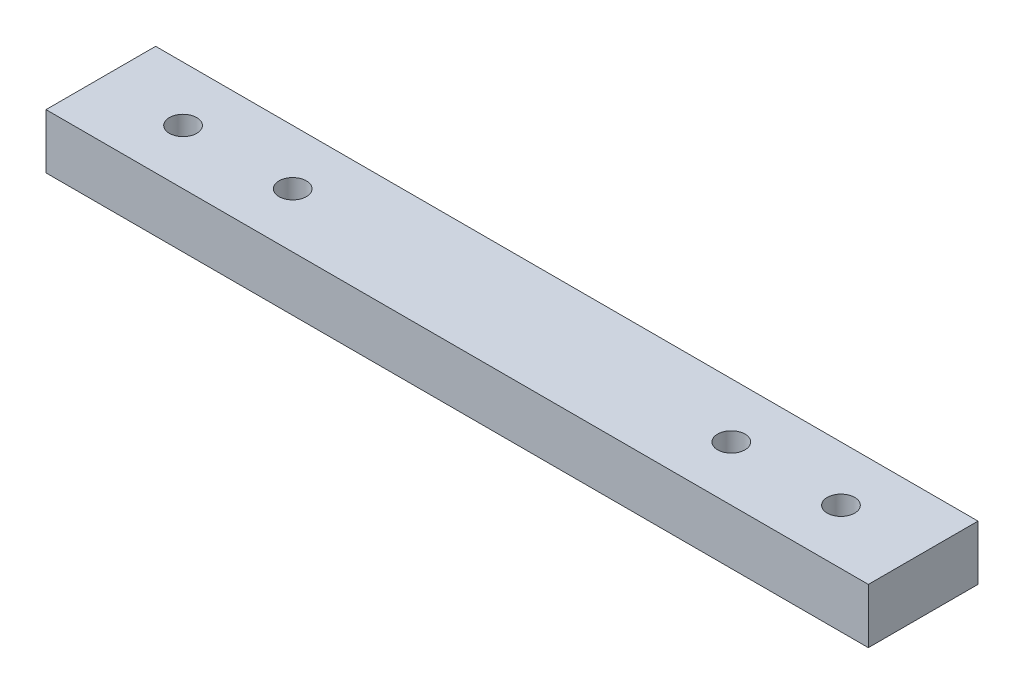
ISO-10303-21;
HEADER;
FILE_DESCRIPTION(('STEP AP214'),'2;1');
FILE_NAME('part.step','',(''),(''),'','','');
FILE_SCHEMA(('AUTOMOTIVE_DESIGN { 1 0 10303 214 1 1 1 1 }'));
ENDSEC;
DATA;
#1=APPLICATION_CONTEXT('core data for automotive mechanical design processes');
#2=APPLICATION_PROTOCOL_DEFINITION('international standard','automotive_design',2000,#1);
#3=PRODUCT_CONTEXT('',#1,'mechanical');
#4=PRODUCT('Part','Part','',(#3));
#5=PRODUCT_RELATED_PRODUCT_CATEGORY('part','',(#4));
#6=PRODUCT_DEFINITION_FORMATION('','',#4);
#7=PRODUCT_DEFINITION_CONTEXT('part definition',#1,'design');
#8=PRODUCT_DEFINITION('design','',#6,#7);
#9=PRODUCT_DEFINITION_SHAPE('','',#8);
#10=(LENGTH_UNIT() NAMED_UNIT(*) SI_UNIT(.MILLI.,.METRE.));
#11=(NAMED_UNIT(*) PLANE_ANGLE_UNIT() SI_UNIT($,.RADIAN.));
#12=(NAMED_UNIT(*) SI_UNIT($,.STERADIAN.) SOLID_ANGLE_UNIT());
#13=UNCERTAINTY_MEASURE_WITH_UNIT(LENGTH_MEASURE(1.E-05),#10,'distance_accuracy_value','');
#14=(GEOMETRIC_REPRESENTATION_CONTEXT(3) GLOBAL_UNCERTAINTY_ASSIGNED_CONTEXT((#13)) GLOBAL_UNIT_ASSIGNED_CONTEXT((#10,
#11,#12)) REPRESENTATION_CONTEXT('',''));
#15=CARTESIAN_POINT('',(0.,0.,0.));
#16=DIRECTION('',(0.,0.,1.));
#17=DIRECTION('',(1.,0.,0.));
#18=AXIS2_PLACEMENT_3D('',#15,#16,#17);
#19=CARTESIAN_POINT('',(0.,10.,0.));
#20=DIRECTION('',(0.,-1.,0.));
#21=DIRECTION('',(0.,0.,-1.));
#22=AXIS2_PLACEMENT_3D('',#19,#20,#21);
#23=PLANE('',#22);
#24=DIRECTION('',(0.,0.,1.));
#25=VECTOR('',#24,1.);
#26=CARTESIAN_POINT('',(0.,10.,0.));
#27=LINE('',#26,#25);
#28=CARTESIAN_POINT('',(0.,10.,-20.));
#29=VERTEX_POINT('',#28);
#30=CARTESIAN_POINT('',(0.,10.,0.));
#31=VERTEX_POINT('',#30);
#32=EDGE_CURVE('E85',#29,#31,#27,.T.);
#33=ORIENTED_EDGE('',*,*,#32,.T.);
#34=DIRECTION('',(1.,0.,0.));
#35=VECTOR('',#34,1.);
#36=CARTESIAN_POINT('',(0.,10.,0.));
#37=LINE('',#36,#35);
#38=CARTESIAN_POINT('',(150.,10.,0.));
#39=VERTEX_POINT('',#38);
#40=EDGE_CURVE('E80',#31,#39,#37,.T.);
#41=ORIENTED_EDGE('',*,*,#40,.T.);
#42=DIRECTION('',(0.,0.,-1.));
#43=VECTOR('',#42,1.);
#44=CARTESIAN_POINT('',(150.,10.,0.));
#45=LINE('',#44,#43);
#46=CARTESIAN_POINT('',(150.,10.,-20.));
#47=VERTEX_POINT('',#46);
#48=EDGE_CURVE('E83',#39,#47,#45,.T.);
#49=ORIENTED_EDGE('',*,*,#48,.T.);
#50=DIRECTION('',(-1.,0.,0.));
#51=VECTOR('',#50,1.);
#52=CARTESIAN_POINT('',(0.,10.,-20.));
#53=LINE('',#52,#51);
#54=EDGE_CURVE('E50',#47,#29,#53,.T.);
#55=ORIENTED_EDGE('',*,*,#54,.T.);
#56=EDGE_LOOP('',(#33,#41,#49,#55));
#57=FACE_BOUND('',#56,.T.);
#58=CARTESIAN_POINT('',(15.,10.,-10.));
#59=DIRECTION('',(0.,1.,0.));
#60=DIRECTION('',(0.,0.,1.));
#61=AXIS2_PLACEMENT_3D('',#58,#59,#60);
#62=CIRCLE('',#61,2.5);
#63=CARTESIAN_POINT('',(15.,10.,-7.5));
#64=VERTEX_POINT('',#63);
#65=EDGE_CURVE('E100',#64,#64,#62,.T.);
#66=ORIENTED_EDGE('',*,*,#65,.F.);
#67=EDGE_LOOP('',(#66));
#68=FACE_BOUND('',#67,.T.);
#69=CARTESIAN_POINT('',(35.,10.,-10.));
#70=DIRECTION('',(0.,1.,0.));
#71=DIRECTION('',(0.,0.,1.));
#72=AXIS2_PLACEMENT_3D('',#69,#70,#71);
#73=CIRCLE('',#72,2.49999999999999);
#74=CARTESIAN_POINT('',(35.,10.,-7.50000000000001));
#75=VERTEX_POINT('',#74);
#76=EDGE_CURVE('E115',#75,#75,#73,.T.);
#77=ORIENTED_EDGE('',*,*,#76,.F.);
#78=EDGE_LOOP('',(#77));
#79=FACE_BOUND('',#78,.T.);
#80=CARTESIAN_POINT('',(115.,10.,-10.));
#81=DIRECTION('',(0.,1.,0.));
#82=DIRECTION('',(0.,0.,1.));
#83=AXIS2_PLACEMENT_3D('',#80,#81,#82);
#84=CIRCLE('',#83,2.49999999999999);
#85=CARTESIAN_POINT('',(115.,10.,-7.50000000000001));
#86=VERTEX_POINT('',#85);
#87=EDGE_CURVE('E121',#86,#86,#84,.T.);
#88=ORIENTED_EDGE('',*,*,#87,.F.);
#89=EDGE_LOOP('',(#88));
#90=FACE_BOUND('',#89,.T.);
#91=CARTESIAN_POINT('',(135.,10.,-10.));
#92=DIRECTION('',(0.,1.,0.));
#93=DIRECTION('',(0.,0.,1.));
#94=AXIS2_PLACEMENT_3D('',#91,#92,#93);
#95=CIRCLE('',#94,2.5);
#96=CARTESIAN_POINT('',(135.,10.,-7.50000000000001));
#97=VERTEX_POINT('',#96);
#98=EDGE_CURVE('E127',#97,#97,#95,.T.);
#99=ORIENTED_EDGE('',*,*,#98,.F.);
#100=EDGE_LOOP('',(#99));
#101=FACE_BOUND('',#100,.T.);
#102=ADVANCED_FACE('F33',(#57,#68,#79,#90,#101),#23,.F.);
#103=CARTESIAN_POINT('',(0.,0.,0.));
#104=DIRECTION('',(0.,-1.,0.));
#105=DIRECTION('',(0.,0.,-1.));
#106=AXIS2_PLACEMENT_3D('',#103,#104,#105);
#107=PLANE('',#106);
#108=CARTESIAN_POINT('',(115.,0.,-10.));
#109=DIRECTION('',(0.,1.,0.));
#110=DIRECTION('',(0.,0.,1.));
#111=AXIS2_PLACEMENT_3D('',#108,#109,#110);
#112=CIRCLE('',#111,2.49999999999999);
#113=CARTESIAN_POINT('',(115.,0.,-7.50000000000001));
#114=VERTEX_POINT('',#113);
#115=EDGE_CURVE('E124',#114,#114,#112,.T.);
#116=ORIENTED_EDGE('',*,*,#115,.T.);
#117=EDGE_LOOP('',(#116));
#118=FACE_BOUND('',#117,.T.);
#119=CARTESIAN_POINT('',(15.,0.,-10.));
#120=DIRECTION('',(0.,1.,0.));
#121=DIRECTION('',(0.,0.,1.));
#122=AXIS2_PLACEMENT_3D('',#119,#120,#121);
#123=CIRCLE('',#122,2.5);
#124=CARTESIAN_POINT('',(15.,0.,-7.5));
#125=VERTEX_POINT('',#124);
#126=EDGE_CURVE('E112',#125,#125,#123,.T.);
#127=ORIENTED_EDGE('',*,*,#126,.T.);
#128=EDGE_LOOP('',(#127));
#129=FACE_BOUND('',#128,.T.);
#130=DIRECTION('',(0.,0.,1.));
#131=VECTOR('',#130,1.);
#132=CARTESIAN_POINT('',(0.,0.,0.));
#133=LINE('',#132,#131);
#134=CARTESIAN_POINT('',(0.,0.,-20.));
#135=VERTEX_POINT('',#134);
#136=CARTESIAN_POINT('',(0.,0.,0.));
#137=VERTEX_POINT('',#136);
#138=EDGE_CURVE('E97',#135,#137,#133,.T.);
#139=ORIENTED_EDGE('',*,*,#138,.F.);
#140=DIRECTION('',(-1.,0.,0.));
#141=VECTOR('',#140,1.);
#142=CARTESIAN_POINT('',(0.,0.,-20.));
#143=LINE('',#142,#141);
#144=CARTESIAN_POINT('',(150.,0.,-20.));
#145=VERTEX_POINT('',#144);
#146=EDGE_CURVE('E73',#145,#135,#143,.T.);
#147=ORIENTED_EDGE('',*,*,#146,.F.);
#148=DIRECTION('',(0.,0.,-1.));
#149=VECTOR('',#148,1.);
#150=CARTESIAN_POINT('',(150.,0.,0.));
#151=LINE('',#150,#149);
#152=CARTESIAN_POINT('',(150.,0.,0.));
#153=VERTEX_POINT('',#152);
#154=EDGE_CURVE('E67',#153,#145,#151,.T.);
#155=ORIENTED_EDGE('',*,*,#154,.F.);
#156=DIRECTION('',(1.,0.,0.));
#157=VECTOR('',#156,1.);
#158=CARTESIAN_POINT('',(0.,0.,0.));
#159=LINE('',#158,#157);
#160=EDGE_CURVE('E89',#137,#153,#159,.T.);
#161=ORIENTED_EDGE('',*,*,#160,.F.);
#162=EDGE_LOOP('',(#139,#147,#155,#161));
#163=FACE_BOUND('',#162,.T.);
#164=CARTESIAN_POINT('',(35.,0.,-10.));
#165=DIRECTION('',(0.,1.,0.));
#166=DIRECTION('',(0.,0.,1.));
#167=AXIS2_PLACEMENT_3D('',#164,#165,#166);
#168=CIRCLE('',#167,2.49999999999999);
#169=CARTESIAN_POINT('',(35.,0.,-7.50000000000001));
#170=VERTEX_POINT('',#169);
#171=EDGE_CURVE('E118',#170,#170,#168,.T.);
#172=ORIENTED_EDGE('',*,*,#171,.T.);
#173=EDGE_LOOP('',(#172));
#174=FACE_BOUND('',#173,.T.);
#175=CARTESIAN_POINT('',(135.,0.,-10.));
#176=DIRECTION('',(0.,1.,0.));
#177=DIRECTION('',(0.,0.,1.));
#178=AXIS2_PLACEMENT_3D('',#175,#176,#177);
#179=CIRCLE('',#178,2.5);
#180=CARTESIAN_POINT('',(135.,0.,-7.50000000000001));
#181=VERTEX_POINT('',#180);
#182=EDGE_CURVE('E130',#181,#181,#179,.T.);
#183=ORIENTED_EDGE('',*,*,#182,.T.);
#184=EDGE_LOOP('',(#183));
#185=FACE_BOUND('',#184,.T.);
#186=ADVANCED_FACE('F108',(#118,#129,#163,#174,#185),#107,.T.);
#187=CARTESIAN_POINT('',(0.,10.,0.));
#188=DIRECTION('',(1.,0.,0.));
#189=DIRECTION('',(0.,0.,-1.));
#190=AXIS2_PLACEMENT_3D('',#187,#188,#189);
#191=PLANE('',#190);
#192=ORIENTED_EDGE('',*,*,#138,.T.);
#193=DIRECTION('',(0.,-1.,0.));
#194=VECTOR('',#193,1.);
#195=CARTESIAN_POINT('',(0.,10.,0.));
#196=LINE('',#195,#194);
#197=EDGE_CURVE('E11',#31,#137,#196,.T.);
#198=ORIENTED_EDGE('',*,*,#197,.F.);
#199=ORIENTED_EDGE('',*,*,#32,.F.);
#200=DIRECTION('',(0.,-1.,0.));
#201=VECTOR('',#200,1.);
#202=CARTESIAN_POINT('',(0.,10.,-20.));
#203=LINE('',#202,#201);
#204=EDGE_CURVE('E93',#29,#135,#203,.T.);
#205=ORIENTED_EDGE('',*,*,#204,.T.);
#206=EDGE_LOOP('',(#192,#198,#199,#205));
#207=FACE_BOUND('',#206,.T.);
#208=ADVANCED_FACE('F35',(#207),#191,.F.);
#209=CARTESIAN_POINT('',(0.,10.,0.));
#210=DIRECTION('',(0.,0.,-1.));
#211=DIRECTION('',(-1.,0.,0.));
#212=AXIS2_PLACEMENT_3D('',#209,#210,#211);
#213=PLANE('',#212);
#214=ORIENTED_EDGE('',*,*,#160,.T.);
#215=DIRECTION('',(0.,-1.,0.));
#216=VECTOR('',#215,1.);
#217=CARTESIAN_POINT('',(150.,10.,0.));
#218=LINE('',#217,#216);
#219=EDGE_CURVE('E42',#39,#153,#218,.T.);
#220=ORIENTED_EDGE('',*,*,#219,.F.);
#221=ORIENTED_EDGE('',*,*,#40,.F.);
#222=ORIENTED_EDGE('',*,*,#197,.T.);
#223=EDGE_LOOP('',(#214,#220,#221,#222));
#224=FACE_BOUND('',#223,.T.);
#225=ADVANCED_FACE('F88',(#224),#213,.F.);
#226=CARTESIAN_POINT('',(150.,10.,0.));
#227=DIRECTION('',(-1.,0.,0.));
#228=DIRECTION('',(0.,0.,1.));
#229=AXIS2_PLACEMENT_3D('',#226,#227,#228);
#230=PLANE('',#229);
#231=ORIENTED_EDGE('',*,*,#154,.T.);
#232=DIRECTION('',(0.,-1.,0.));
#233=VECTOR('',#232,1.);
#234=CARTESIAN_POINT('',(150.,10.,-20.));
#235=LINE('',#234,#233);
#236=EDGE_CURVE('E90',#47,#145,#235,.T.);
#237=ORIENTED_EDGE('',*,*,#236,.F.);
#238=ORIENTED_EDGE('',*,*,#48,.F.);
#239=ORIENTED_EDGE('',*,*,#219,.T.);
#240=EDGE_LOOP('',(#231,#237,#238,#239));
#241=FACE_BOUND('',#240,.T.);
#242=ADVANCED_FACE('F91',(#241),#230,.F.);
#243=CARTESIAN_POINT('',(0.,10.,-20.));
#244=DIRECTION('',(0.,0.,1.));
#245=DIRECTION('',(1.,0.,0.));
#246=AXIS2_PLACEMENT_3D('',#243,#244,#245);
#247=PLANE('',#246);
#248=ORIENTED_EDGE('',*,*,#146,.T.);
#249=ORIENTED_EDGE('',*,*,#204,.F.);
#250=ORIENTED_EDGE('',*,*,#54,.F.);
#251=ORIENTED_EDGE('',*,*,#236,.T.);
#252=EDGE_LOOP('',(#248,#249,#250,#251));
#253=FACE_BOUND('',#252,.T.);
#254=ADVANCED_FACE('F105',(#253),#247,.F.);
#255=CARTESIAN_POINT('',(15.,10.,-10.));
#256=DIRECTION('',(0.,-1.,0.));
#257=DIRECTION('',(0.,0.,-1.));
#258=AXIS2_PLACEMENT_3D('',#255,#256,#257);
#259=CYLINDRICAL_SURFACE('',#258,2.5);
#260=ORIENTED_EDGE('',*,*,#65,.T.);
#261=EDGE_LOOP('',(#260));
#262=FACE_BOUND('',#261,.T.);
#263=ORIENTED_EDGE('',*,*,#126,.F.);
#264=EDGE_LOOP('',(#263));
#265=FACE_BOUND('',#264,.T.);
#266=ADVANCED_FACE('F147',(#262,#265),#259,.F.);
#267=CARTESIAN_POINT('',(35.,10.,-10.));
#268=DIRECTION('',(0.,-1.,0.));
#269=DIRECTION('',(0.,0.,-1.));
#270=AXIS2_PLACEMENT_3D('',#267,#268,#269);
#271=CYLINDRICAL_SURFACE('',#270,2.49999999999999);
#272=ORIENTED_EDGE('',*,*,#76,.T.);
#273=EDGE_LOOP('',(#272));
#274=FACE_BOUND('',#273,.T.);
#275=ORIENTED_EDGE('',*,*,#171,.F.);
#276=EDGE_LOOP('',(#275));
#277=FACE_BOUND('',#276,.T.);
#278=ADVANCED_FACE('F193',(#274,#277),#271,.F.);
#279=CARTESIAN_POINT('',(115.,10.,-10.));
#280=DIRECTION('',(0.,-1.,0.));
#281=DIRECTION('',(0.,0.,-1.));
#282=AXIS2_PLACEMENT_3D('',#279,#280,#281);
#283=CYLINDRICAL_SURFACE('',#282,2.49999999999999);
#284=ORIENTED_EDGE('',*,*,#87,.T.);
#285=EDGE_LOOP('',(#284));
#286=FACE_BOUND('',#285,.T.);
#287=ORIENTED_EDGE('',*,*,#115,.F.);
#288=EDGE_LOOP('',(#287));
#289=FACE_BOUND('',#288,.T.);
#290=ADVANCED_FACE('F201',(#286,#289),#283,.F.);
#291=CARTESIAN_POINT('',(135.,10.,-10.));
#292=DIRECTION('',(0.,-1.,0.));
#293=DIRECTION('',(0.,0.,-1.));
#294=AXIS2_PLACEMENT_3D('',#291,#292,#293);
#295=CYLINDRICAL_SURFACE('',#294,2.5);
#296=ORIENTED_EDGE('',*,*,#98,.T.);
#297=EDGE_LOOP('',(#296));
#298=FACE_BOUND('',#297,.T.);
#299=ORIENTED_EDGE('',*,*,#182,.F.);
#300=EDGE_LOOP('',(#299));
#301=FACE_BOUND('',#300,.T.);
#302=ADVANCED_FACE('F136',(#298,#301),#295,.F.);
#303=CLOSED_SHELL('',(#102,#186,#208,#225,#242,#254,#266,#278,#290,#302));
#304=MANIFOLD_SOLID_BREP('B2',#303);
#305=ADVANCED_BREP_SHAPE_REPRESENTATION('',(#18,#304),#14);
#306=SHAPE_DEFINITION_REPRESENTATION(#9,#305);
ENDSEC;
END-ISO-10303-21;
